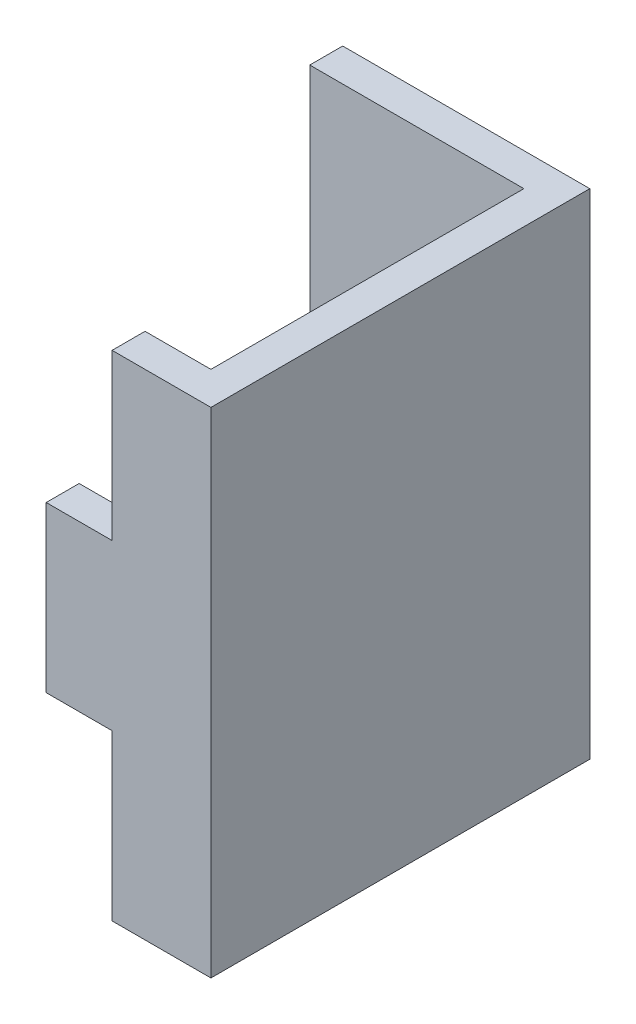
ISO-10303-21;
HEADER;
FILE_DESCRIPTION(('STEP AP214'),'2;1');
FILE_NAME('part.step','',(''),(''),'','','');
FILE_SCHEMA(('AUTOMOTIVE_DESIGN { 1 0 10303 214 1 1 1 1 }'));
ENDSEC;
DATA;
#1=APPLICATION_CONTEXT('core data for automotive mechanical design processes');
#2=APPLICATION_PROTOCOL_DEFINITION('international standard','automotive_design',2000,#1);
#3=PRODUCT_CONTEXT('',#1,'mechanical');
#4=PRODUCT('Part','Part','',(#3));
#5=PRODUCT_RELATED_PRODUCT_CATEGORY('part','',(#4));
#6=PRODUCT_DEFINITION_FORMATION('','',#4);
#7=PRODUCT_DEFINITION_CONTEXT('part definition',#1,'design');
#8=PRODUCT_DEFINITION('design','',#6,#7);
#9=PRODUCT_DEFINITION_SHAPE('','',#8);
#10=(LENGTH_UNIT() NAMED_UNIT(*) SI_UNIT(.MILLI.,.METRE.));
#11=(NAMED_UNIT(*) PLANE_ANGLE_UNIT() SI_UNIT($,.RADIAN.));
#12=(NAMED_UNIT(*) SI_UNIT($,.STERADIAN.) SOLID_ANGLE_UNIT());
#13=UNCERTAINTY_MEASURE_WITH_UNIT(LENGTH_MEASURE(1.E-05),#10,'distance_accuracy_value','');
#14=(GEOMETRIC_REPRESENTATION_CONTEXT(3) GLOBAL_UNCERTAINTY_ASSIGNED_CONTEXT((#13)) GLOBAL_UNIT_ASSIGNED_CONTEXT((#10,
#11,#12)) REPRESENTATION_CONTEXT('',''));
#15=CARTESIAN_POINT('',(0.,0.,0.));
#16=DIRECTION('',(0.,0.,1.));
#17=DIRECTION('',(1.,0.,0.));
#18=AXIS2_PLACEMENT_3D('',#15,#16,#17);
#19=CARTESIAN_POINT('',(11.0242,5.547770604355,1.00916));
#20=DIRECTION('',(0.,0.,-1.));
#21=DIRECTION('',(-1.,0.,0.));
#22=AXIS2_PLACEMENT_3D('',#19,#20,#21);
#23=PLANE('',#22);
#24=DIRECTION('',(0.,1.,0.));
#25=VECTOR('',#24,1.);
#26=CARTESIAN_POINT('',(11.0242,5.547770604355,1.00916));
#27=LINE('',#26,#25);
#28=CARTESIAN_POINT('',(11.0242,4.97318,1.00916));
#29=VERTEX_POINT('',#28);
#30=CARTESIAN_POINT('',(11.0242,5.27318,1.00916));
#31=VERTEX_POINT('',#30);
#32=EDGE_CURVE('E123',#29,#31,#27,.T.);
#33=ORIENTED_EDGE('',*,*,#32,.F.);
#34=DIRECTION('',(-1.,0.,0.));
#35=VECTOR('',#34,1.);
#36=CARTESIAN_POINT('',(11.0242,4.97318,1.00916));
#37=LINE('',#36,#35);
#38=CARTESIAN_POINT('',(10.9842,4.97318,1.00916));
#39=VERTEX_POINT('',#38);
#40=EDGE_CURVE('E111',#29,#39,#37,.T.);
#41=ORIENTED_EDGE('',*,*,#40,.T.);
#42=DIRECTION('',(0.,1.,0.));
#43=VECTOR('',#42,1.);
#44=CARTESIAN_POINT('',(10.9842,4.97318,1.00916));
#45=LINE('',#44,#43);
#46=CARTESIAN_POINT('',(10.9842,5.07318,1.00916));
#47=VERTEX_POINT('',#46);
#48=EDGE_CURVE('E117',#39,#47,#45,.T.);
#49=ORIENTED_EDGE('',*,*,#48,.T.);
#50=DIRECTION('',(1.,0.,0.));
#51=VECTOR('',#50,1.);
#52=CARTESIAN_POINT('',(10.9842,5.07318,1.00916));
#53=LINE('',#52,#51);
#54=CARTESIAN_POINT('',(10.9442,5.07318,1.00916));
#55=VERTEX_POINT('',#54);
#56=EDGE_CURVE('E144',#47,#55,#53,.F.);
#57=ORIENTED_EDGE('',*,*,#56,.T.);
#58=DIRECTION('',(0.,1.,0.));
#59=VECTOR('',#58,1.);
#60=CARTESIAN_POINT('',(10.9442,5.547770604355,1.00916));
#61=LINE('',#60,#59);
#62=CARTESIAN_POINT('',(10.9442,5.17318,1.00916));
#63=VERTEX_POINT('',#62);
#64=EDGE_CURVE('E139',#63,#55,#61,.F.);
#65=ORIENTED_EDGE('',*,*,#64,.F.);
#66=DIRECTION('',(1.,0.,0.));
#67=VECTOR('',#66,1.);
#68=CARTESIAN_POINT('',(10.9842,5.17318,1.00916));
#69=LINE('',#68,#67);
#70=CARTESIAN_POINT('',(10.9842,5.17318,1.00916));
#71=VERTEX_POINT('',#70);
#72=EDGE_CURVE('E134',#63,#71,#69,.T.);
#73=ORIENTED_EDGE('',*,*,#72,.T.);
#74=DIRECTION('',(0.,1.,0.));
#75=VECTOR('',#74,1.);
#76=CARTESIAN_POINT('',(10.9842,5.27318,1.00916));
#77=LINE('',#76,#75);
#78=CARTESIAN_POINT('',(10.9842,5.27318,1.00916));
#79=VERTEX_POINT('',#78);
#80=EDGE_CURVE('E103',#71,#79,#77,.T.);
#81=ORIENTED_EDGE('',*,*,#80,.T.);
#82=DIRECTION('',(-1.,0.,0.));
#83=VECTOR('',#82,1.);
#84=CARTESIAN_POINT('',(11.0242,5.27318,1.00916));
#85=LINE('',#84,#83);
#86=EDGE_CURVE('E20',#79,#31,#85,.F.);
#87=ORIENTED_EDGE('',*,*,#86,.T.);
#88=EDGE_LOOP('',(#33,#41,#49,#57,#65,#73,#81,#87));
#89=FACE_BOUND('',#88,.T.);
#90=ADVANCED_FACE('F17',(#89),#23,.T.);
#91=CARTESIAN_POINT('',(10.9842,4.97318,0.901456703857));
#92=DIRECTION('',(1.,0.,0.));
#93=DIRECTION('',(0.,0.,-1.));
#94=AXIS2_PLACEMENT_3D('',#91,#92,#93);
#95=PLANE('',#94);
#96=DIRECTION('',(0.,0.,-1.));
#97=VECTOR('',#96,1.);
#98=CARTESIAN_POINT('',(10.9842,4.97318,0.901456703857));
#99=LINE('',#98,#97);
#100=CARTESIAN_POINT('',(10.9842,4.97318,1.02916));
#101=VERTEX_POINT('',#100);
#102=EDGE_CURVE('E107',#101,#39,#99,.T.);
#103=ORIENTED_EDGE('',*,*,#102,.F.);
#104=DIRECTION('',(0.,1.,0.));
#105=VECTOR('',#104,1.);
#106=CARTESIAN_POINT('',(10.9842,5.547770604355,1.02916));
#107=LINE('',#106,#105);
#108=CARTESIAN_POINT('',(10.9842,5.07318,1.02916));
#109=VERTEX_POINT('',#108);
#110=EDGE_CURVE('E161',#109,#101,#107,.F.);
#111=ORIENTED_EDGE('',*,*,#110,.F.);
#112=DIRECTION('',(0.,0.,1.));
#113=VECTOR('',#112,1.);
#114=CARTESIAN_POINT('',(10.9842,5.07318,0.901456703857));
#115=LINE('',#114,#113);
#116=EDGE_CURVE('E127',#109,#47,#115,.F.);
#117=ORIENTED_EDGE('',*,*,#116,.T.);
#118=ORIENTED_EDGE('',*,*,#48,.F.);
#119=EDGE_LOOP('',(#103,#111,#117,#118));
#120=FACE_BOUND('',#119,.T.);
#121=ADVANCED_FACE('F125',(#120),#95,.F.);
#122=CARTESIAN_POINT('',(10.9842,5.27318,0.901456703857));
#123=DIRECTION('',(1.,0.,0.));
#124=DIRECTION('',(0.,0.,-1.));
#125=AXIS2_PLACEMENT_3D('',#122,#123,#124);
#126=PLANE('',#125);
#127=DIRECTION('',(0.,0.,-1.));
#128=VECTOR('',#127,1.);
#129=CARTESIAN_POINT('',(10.9842,5.17318,0.901456703857));
#130=LINE('',#129,#128);
#131=CARTESIAN_POINT('',(10.9842,5.17318,1.02916));
#132=VERTEX_POINT('',#131);
#133=EDGE_CURVE('E130',#71,#132,#130,.F.);
#134=ORIENTED_EDGE('',*,*,#133,.T.);
#135=DIRECTION('',(0.,1.,0.));
#136=VECTOR('',#135,1.);
#137=CARTESIAN_POINT('',(10.9842,5.547770604355,1.02916));
#138=LINE('',#137,#136);
#139=CARTESIAN_POINT('',(10.9842,5.27318,1.02916));
#140=VERTEX_POINT('',#139);
#141=EDGE_CURVE('E166',#140,#132,#138,.F.);
#142=ORIENTED_EDGE('',*,*,#141,.F.);
#143=DIRECTION('',(0.,0.,-1.));
#144=VECTOR('',#143,1.);
#145=CARTESIAN_POINT('',(10.9842,5.27318,1.00916));
#146=LINE('',#145,#144);
#147=EDGE_CURVE('E159',#140,#79,#146,.T.);
#148=ORIENTED_EDGE('',*,*,#147,.T.);
#149=ORIENTED_EDGE('',*,*,#80,.F.);
#150=EDGE_LOOP('',(#134,#142,#148,#149));
#151=FACE_BOUND('',#150,.T.);
#152=ADVANCED_FACE('F218',(#151),#126,.F.);
#153=CARTESIAN_POINT('',(10.9842,5.17318,0.901456703857));
#154=DIRECTION('',(0.,-1.,0.));
#155=DIRECTION('',(0.,0.,-1.));
#156=AXIS2_PLACEMENT_3D('',#153,#154,#155);
#157=PLANE('',#156);
#158=DIRECTION('',(0.,0.,1.));
#159=VECTOR('',#158,1.);
#160=CARTESIAN_POINT('',(10.9442,5.17318,1.00916));
#161=LINE('',#160,#159);
#162=CARTESIAN_POINT('',(10.9442,5.17318,1.02916));
#163=VERTEX_POINT('',#162);
#164=EDGE_CURVE('E136',#163,#63,#161,.F.);
#165=ORIENTED_EDGE('',*,*,#164,.F.);
#166=DIRECTION('',(1.,0.,0.));
#167=VECTOR('',#166,1.);
#168=CARTESIAN_POINT('',(10.9442,5.17318,1.02916));
#169=LINE('',#168,#167);
#170=EDGE_CURVE('E169',#132,#163,#169,.F.);
#171=ORIENTED_EDGE('',*,*,#170,.F.);
#172=ORIENTED_EDGE('',*,*,#133,.F.);
#173=ORIENTED_EDGE('',*,*,#72,.F.);
#174=EDGE_LOOP('',(#165,#171,#172,#173));
#175=FACE_BOUND('',#174,.T.);
#176=ADVANCED_FACE('F216',(#175),#157,.F.);
#177=CARTESIAN_POINT('',(10.9442,5.547770604355,1.00916));
#178=DIRECTION('',(-1.,0.,0.));
#179=DIRECTION('',(0.,0.,1.));
#180=AXIS2_PLACEMENT_3D('',#177,#178,#179);
#181=PLANE('',#180);
#182=ORIENTED_EDGE('',*,*,#164,.T.);
#183=ORIENTED_EDGE('',*,*,#64,.T.);
#184=DIRECTION('',(0.,0.,1.));
#185=VECTOR('',#184,1.);
#186=CARTESIAN_POINT('',(10.9442,5.07318,0.901456703857));
#187=LINE('',#186,#185);
#188=CARTESIAN_POINT('',(10.9442,5.07318,1.02916));
#189=VERTEX_POINT('',#188);
#190=EDGE_CURVE('E141',#55,#189,#187,.T.);
#191=ORIENTED_EDGE('',*,*,#190,.T.);
#192=DIRECTION('',(0.,1.,0.));
#193=VECTOR('',#192,1.);
#194=CARTESIAN_POINT('',(10.9442,5.547770604355,1.02916));
#195=LINE('',#194,#193);
#196=EDGE_CURVE('E172',#163,#189,#195,.F.);
#197=ORIENTED_EDGE('',*,*,#196,.F.);
#198=EDGE_LOOP('',(#182,#183,#191,#197));
#199=FACE_BOUND('',#198,.T.);
#200=ADVANCED_FACE('F213',(#199),#181,.T.);
#201=CARTESIAN_POINT('',(10.9842,5.07318,0.901456703857));
#202=DIRECTION('',(0.,1.,0.));
#203=DIRECTION('',(0.,0.,1.));
#204=AXIS2_PLACEMENT_3D('',#201,#202,#203);
#205=PLANE('',#204);
#206=ORIENTED_EDGE('',*,*,#116,.F.);
#207=DIRECTION('',(1.,0.,0.));
#208=VECTOR('',#207,1.);
#209=CARTESIAN_POINT('',(10.9442,5.07318,1.02916));
#210=LINE('',#209,#208);
#211=EDGE_CURVE('E175',#189,#109,#210,.T.);
#212=ORIENTED_EDGE('',*,*,#211,.F.);
#213=ORIENTED_EDGE('',*,*,#190,.F.);
#214=ORIENTED_EDGE('',*,*,#56,.F.);
#215=EDGE_LOOP('',(#206,#212,#213,#214));
#216=FACE_BOUND('',#215,.T.);
#217=ADVANCED_FACE('F207',(#216),#205,.F.);
#218=CARTESIAN_POINT('',(11.0242,5.547770604355,0.81916));
#219=DIRECTION('',(-1.,0.,0.));
#220=DIRECTION('',(0.,0.,1.));
#221=AXIS2_PLACEMENT_3D('',#218,#219,#220);
#222=PLANE('',#221);
#223=DIRECTION('',(0.,0.,-1.));
#224=VECTOR('',#223,1.);
#225=CARTESIAN_POINT('',(11.0242,4.97318,0.81916));
#226=LINE('',#225,#224);
#227=CARTESIAN_POINT('',(11.0242,4.97318,0.81916));
#228=VERTEX_POINT('',#227);
#229=EDGE_CURVE('E178',#29,#228,#226,.T.);
#230=ORIENTED_EDGE('',*,*,#229,.F.);
#231=ORIENTED_EDGE('',*,*,#32,.T.);
#232=DIRECTION('',(0.,0.,-1.));
#233=VECTOR('',#232,1.);
#234=CARTESIAN_POINT('',(11.0242,5.27318,1.00916));
#235=LINE('',#234,#233);
#236=CARTESIAN_POINT('',(11.0242,5.27318,0.81916));
#237=VERTEX_POINT('',#236);
#238=EDGE_CURVE('E153',#31,#237,#235,.T.);
#239=ORIENTED_EDGE('',*,*,#238,.T.);
#240=DIRECTION('',(0.,-1.,0.));
#241=VECTOR('',#240,1.);
#242=CARTESIAN_POINT('',(11.0242,5.547770604355,0.81916));
#243=LINE('',#242,#241);
#244=EDGE_CURVE('E147',#228,#237,#243,.F.);
#245=ORIENTED_EDGE('',*,*,#244,.F.);
#246=EDGE_LOOP('',(#230,#231,#239,#245));
#247=FACE_BOUND('',#246,.T.);
#248=ADVANCED_FACE('F224',(#247),#222,.T.);
#249=CARTESIAN_POINT('',(10.8942,5.547770604355,0.81916));
#250=DIRECTION('',(0.,0.,1.));
#251=DIRECTION('',(0.,-1.,0.));
#252=AXIS2_PLACEMENT_3D('',#249,#250,#251);
#253=PLANE('',#252);
#254=DIRECTION('',(1.,0.,0.));
#255=VECTOR('',#254,1.);
#256=CARTESIAN_POINT('',(10.7442,4.97318,0.81916));
#257=LINE('',#256,#255);
#258=CARTESIAN_POINT('',(10.8942,4.97318,0.81916));
#259=VERTEX_POINT('',#258);
#260=EDGE_CURVE('E180',#228,#259,#257,.F.);
#261=ORIENTED_EDGE('',*,*,#260,.F.);
#262=ORIENTED_EDGE('',*,*,#244,.T.);
#263=DIRECTION('',(1.,0.,0.));
#264=VECTOR('',#263,1.);
#265=CARTESIAN_POINT('',(11.0242,5.27318,0.81916));
#266=LINE('',#265,#264);
#267=CARTESIAN_POINT('',(10.8942,5.27318,0.81916));
#268=VERTEX_POINT('',#267);
#269=EDGE_CURVE('E155',#237,#268,#266,.F.);
#270=ORIENTED_EDGE('',*,*,#269,.T.);
#271=DIRECTION('',(0.,1.,0.));
#272=VECTOR('',#271,1.);
#273=CARTESIAN_POINT('',(10.8942,5.547770604355,0.81916));
#274=LINE('',#273,#272);
#275=EDGE_CURVE('E150',#259,#268,#274,.T.);
#276=ORIENTED_EDGE('',*,*,#275,.F.);
#277=EDGE_LOOP('',(#261,#262,#270,#276));
#278=FACE_BOUND('',#277,.T.);
#279=ADVANCED_FACE('F229',(#278),#253,.T.);
#280=CARTESIAN_POINT('',(10.8942,5.547770604355,0.79916));
#281=DIRECTION('',(-1.,0.,0.));
#282=DIRECTION('',(0.,0.,1.));
#283=AXIS2_PLACEMENT_3D('',#280,#281,#282);
#284=PLANE('',#283);
#285=DIRECTION('',(0.,0.,-1.));
#286=VECTOR('',#285,1.);
#287=CARTESIAN_POINT('',(10.8942,4.97318,0.81916));
#288=LINE('',#287,#286);
#289=CARTESIAN_POINT('',(10.8942,4.97318,0.79916));
#290=VERTEX_POINT('',#289);
#291=EDGE_CURVE('E183',#259,#290,#288,.T.);
#292=ORIENTED_EDGE('',*,*,#291,.F.);
#293=ORIENTED_EDGE('',*,*,#275,.T.);
#294=DIRECTION('',(0.,0.,-1.));
#295=VECTOR('',#294,1.);
#296=CARTESIAN_POINT('',(10.8942,5.27318,1.00916));
#297=LINE('',#296,#295);
#298=CARTESIAN_POINT('',(10.8942,5.27318,0.79916));
#299=VERTEX_POINT('',#298);
#300=EDGE_CURVE('E157',#268,#299,#297,.T.);
#301=ORIENTED_EDGE('',*,*,#300,.T.);
#302=DIRECTION('',(0.,1.,0.));
#303=VECTOR('',#302,1.);
#304=CARTESIAN_POINT('',(10.8942,5.547770604355,0.79916));
#305=LINE('',#304,#303);
#306=EDGE_CURVE('E190',#290,#299,#305,.T.);
#307=ORIENTED_EDGE('',*,*,#306,.F.);
#308=EDGE_LOOP('',(#292,#293,#301,#307));
#309=FACE_BOUND('',#308,.T.);
#310=ADVANCED_FACE('F232',(#309),#284,.T.);
#311=CARTESIAN_POINT('',(11.0242,5.27318,1.00916));
#312=DIRECTION('',(0.,-1.,0.));
#313=DIRECTION('',(0.,0.,-1.));
#314=AXIS2_PLACEMENT_3D('',#311,#312,#313);
#315=PLANE('',#314);
#316=ORIENTED_EDGE('',*,*,#147,.F.);
#317=DIRECTION('',(1.,0.,0.));
#318=VECTOR('',#317,1.);
#319=CARTESIAN_POINT('',(10.9442,5.27318,1.02916));
#320=LINE('',#319,#318);
#321=CARTESIAN_POINT('',(11.0442,5.27318,1.02916));
#322=VERTEX_POINT('',#321);
#323=EDGE_CURVE('E163',#322,#140,#320,.F.);
#324=ORIENTED_EDGE('',*,*,#323,.F.);
#325=DIRECTION('',(0.,0.,-1.));
#326=VECTOR('',#325,1.);
#327=CARTESIAN_POINT('',(11.0442,5.27318,1.02916));
#328=LINE('',#327,#326);
#329=CARTESIAN_POINT('',(11.0442,5.27318,0.79916));
#330=VERTEX_POINT('',#329);
#331=EDGE_CURVE('E193',#330,#322,#328,.F.);
#332=ORIENTED_EDGE('',*,*,#331,.F.);
#333=DIRECTION('',(-1.,0.,0.));
#334=VECTOR('',#333,1.);
#335=CARTESIAN_POINT('',(11.0442,5.27318,0.79916));
#336=LINE('',#335,#334);
#337=EDGE_CURVE('E186',#299,#330,#336,.F.);
#338=ORIENTED_EDGE('',*,*,#337,.F.);
#339=ORIENTED_EDGE('',*,*,#300,.F.);
#340=ORIENTED_EDGE('',*,*,#269,.F.);
#341=ORIENTED_EDGE('',*,*,#238,.F.);
#342=ORIENTED_EDGE('',*,*,#86,.F.);
#343=EDGE_LOOP('',(#316,#324,#332,#338,#339,#340,#341,#342));
#344=FACE_BOUND('',#343,.T.);
#345=ADVANCED_FACE('F220',(#344),#315,.F.);
#346=CARTESIAN_POINT('',(10.9442,5.547770604355,1.02916));
#347=DIRECTION('',(0.,0.,1.));
#348=DIRECTION('',(1.,0.,0.));
#349=AXIS2_PLACEMENT_3D('',#346,#347,#348);
#350=PLANE('',#349);
#351=ORIENTED_EDGE('',*,*,#196,.T.);
#352=ORIENTED_EDGE('',*,*,#211,.T.);
#353=ORIENTED_EDGE('',*,*,#110,.T.);
#354=DIRECTION('',(1.,0.,0.));
#355=VECTOR('',#354,1.);
#356=CARTESIAN_POINT('',(10.7442,4.97318,1.02916));
#357=LINE('',#356,#355);
#358=CARTESIAN_POINT('',(11.0442,4.97318,1.02916));
#359=VERTEX_POINT('',#358);
#360=EDGE_CURVE('E113',#359,#101,#357,.F.);
#361=ORIENTED_EDGE('',*,*,#360,.F.);
#362=DIRECTION('',(0.,1.,0.));
#363=VECTOR('',#362,1.);
#364=CARTESIAN_POINT('',(11.0442,5.547770604355,1.02916));
#365=LINE('',#364,#363);
#366=EDGE_CURVE('E196',#322,#359,#365,.F.);
#367=ORIENTED_EDGE('',*,*,#366,.F.);
#368=ORIENTED_EDGE('',*,*,#323,.T.);
#369=ORIENTED_EDGE('',*,*,#141,.T.);
#370=ORIENTED_EDGE('',*,*,#170,.T.);
#371=EDGE_LOOP('',(#351,#352,#353,#361,#367,#368,#369,#370));
#372=FACE_BOUND('',#371,.T.);
#373=ADVANCED_FACE('F204',(#372),#350,.T.);
#374=CARTESIAN_POINT('',(10.7442,4.97318,0.81916));
#375=DIRECTION('',(0.,-1.,0.));
#376=DIRECTION('',(0.,0.,-1.));
#377=AXIS2_PLACEMENT_3D('',#374,#375,#376);
#378=PLANE('',#377);
#379=DIRECTION('',(0.,0.,-1.));
#380=VECTOR('',#379,1.);
#381=CARTESIAN_POINT('',(11.0442,4.97318,1.02916));
#382=LINE('',#381,#380);
#383=CARTESIAN_POINT('',(11.0442,4.97318,0.79916));
#384=VERTEX_POINT('',#383);
#385=EDGE_CURVE('E26',#359,#384,#382,.T.);
#386=ORIENTED_EDGE('',*,*,#385,.F.);
#387=ORIENTED_EDGE('',*,*,#360,.T.);
#388=ORIENTED_EDGE('',*,*,#102,.T.);
#389=ORIENTED_EDGE('',*,*,#40,.F.);
#390=ORIENTED_EDGE('',*,*,#229,.T.);
#391=ORIENTED_EDGE('',*,*,#260,.T.);
#392=ORIENTED_EDGE('',*,*,#291,.T.);
#393=DIRECTION('',(-1.,0.,0.));
#394=VECTOR('',#393,1.);
#395=CARTESIAN_POINT('',(11.0442,4.97318,0.79916));
#396=LINE('',#395,#394);
#397=EDGE_CURVE('E35',#384,#290,#396,.T.);
#398=ORIENTED_EDGE('',*,*,#397,.F.);
#399=EDGE_LOOP('',(#386,#387,#388,#389,#390,#391,#392,#398));
#400=FACE_BOUND('',#399,.T.);
#401=ADVANCED_FACE('F109',(#400),#378,.T.);
#402=CARTESIAN_POINT('',(11.0442,5.547770604355,0.79916));
#403=DIRECTION('',(0.,0.,-1.));
#404=DIRECTION('',(-1.,0.,0.));
#405=AXIS2_PLACEMENT_3D('',#402,#403,#404);
#406=PLANE('',#405);
#407=ORIENTED_EDGE('',*,*,#397,.T.);
#408=ORIENTED_EDGE('',*,*,#306,.T.);
#409=ORIENTED_EDGE('',*,*,#337,.T.);
#410=DIRECTION('',(0.,1.,0.));
#411=VECTOR('',#410,1.);
#412=CARTESIAN_POINT('',(11.0442,5.547770604355,0.79916));
#413=LINE('',#412,#411);
#414=EDGE_CURVE('E11',#384,#330,#413,.T.);
#415=ORIENTED_EDGE('',*,*,#414,.F.);
#416=EDGE_LOOP('',(#407,#408,#409,#415));
#417=FACE_BOUND('',#416,.T.);
#418=ADVANCED_FACE('F235',(#417),#406,.T.);
#419=CARTESIAN_POINT('',(11.0442,5.547770604355,1.02916));
#420=DIRECTION('',(1.,0.,0.));
#421=DIRECTION('',(0.,0.,-1.));
#422=AXIS2_PLACEMENT_3D('',#419,#420,#421);
#423=PLANE('',#422);
#424=ORIENTED_EDGE('',*,*,#385,.T.);
#425=ORIENTED_EDGE('',*,*,#414,.T.);
#426=ORIENTED_EDGE('',*,*,#331,.T.);
#427=ORIENTED_EDGE('',*,*,#366,.T.);
#428=EDGE_LOOP('',(#424,#425,#426,#427));
#429=FACE_BOUND('',#428,.T.);
#430=ADVANCED_FACE('F201',(#429),#423,.T.);
#431=CLOSED_SHELL('',(#90,#121,#152,#176,#200,#217,#248,#279,#310,#345,#373,#401,#418,#430));
#432=MANIFOLD_SOLID_BREP('B1',#431);
#433=ADVANCED_BREP_SHAPE_REPRESENTATION('',(#18,#432),#14);
#434=SHAPE_DEFINITION_REPRESENTATION(#9,#433);
ENDSEC;
END-ISO-10303-21;
